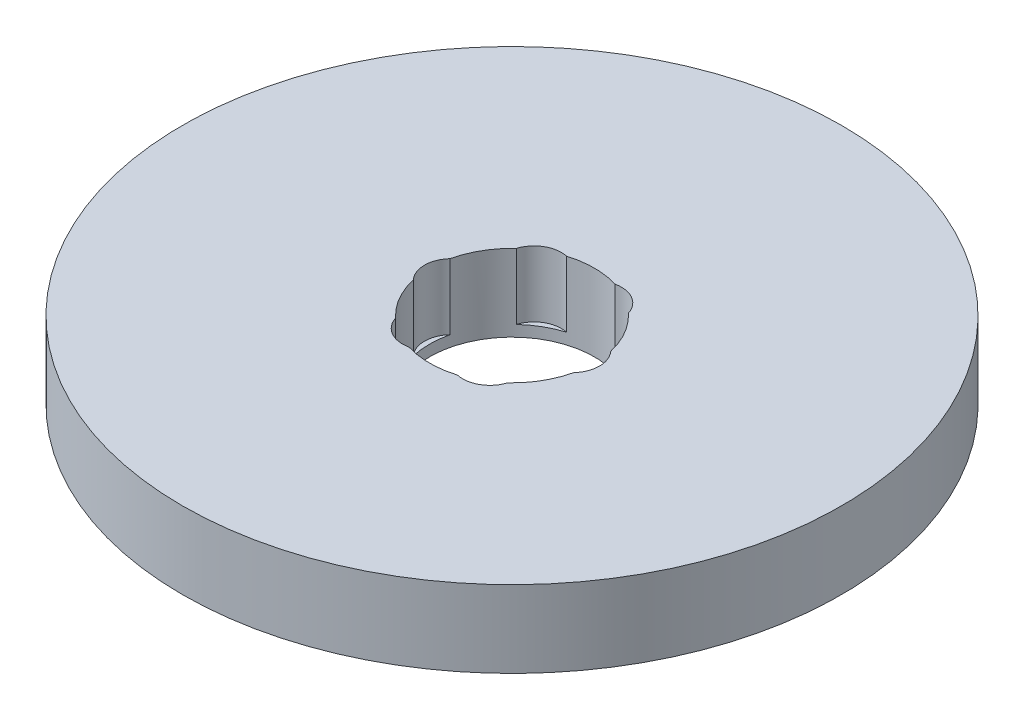
ISO-10303-21;
HEADER;
FILE_DESCRIPTION(('STEP AP214'),'2;1');
FILE_NAME('part.step','',(''),(''),'','','');
FILE_SCHEMA(('AUTOMOTIVE_DESIGN { 1 0 10303 214 1 1 1 1 }'));
ENDSEC;
DATA;
#1=APPLICATION_CONTEXT('core data for automotive mechanical design processes');
#2=APPLICATION_PROTOCOL_DEFINITION('international standard','automotive_design',2000,#1);
#3=PRODUCT_CONTEXT('',#1,'mechanical');
#4=PRODUCT('Part','Part','',(#3));
#5=PRODUCT_RELATED_PRODUCT_CATEGORY('part','',(#4));
#6=PRODUCT_DEFINITION_FORMATION('','',#4);
#7=PRODUCT_DEFINITION_CONTEXT('part definition',#1,'design');
#8=PRODUCT_DEFINITION('design','',#6,#7);
#9=PRODUCT_DEFINITION_SHAPE('','',#8);
#10=(LENGTH_UNIT() NAMED_UNIT(*) SI_UNIT(.MILLI.,.METRE.));
#11=(NAMED_UNIT(*) PLANE_ANGLE_UNIT() SI_UNIT($,.RADIAN.));
#12=(NAMED_UNIT(*) SI_UNIT($,.STERADIAN.) SOLID_ANGLE_UNIT());
#13=UNCERTAINTY_MEASURE_WITH_UNIT(LENGTH_MEASURE(1.E-05),#10,'distance_accuracy_value','');
#14=(GEOMETRIC_REPRESENTATION_CONTEXT(3) GLOBAL_UNCERTAINTY_ASSIGNED_CONTEXT((#13)) GLOBAL_UNIT_ASSIGNED_CONTEXT((#10,
#11,#12)) REPRESENTATION_CONTEXT('',''));
#15=CARTESIAN_POINT('',(0.,0.,0.));
#16=DIRECTION('',(0.,0.,1.));
#17=DIRECTION('',(1.,0.,0.));
#18=AXIS2_PLACEMENT_3D('',#15,#16,#17);
#19=CARTESIAN_POINT('',(0.,21.,0.));
#20=DIRECTION('',(0.,-1.,0.));
#21=DIRECTION('',(0.,0.,-1.));
#22=AXIS2_PLACEMENT_3D('',#19,#20,#21);
#23=CYLINDRICAL_SURFACE('',#22,90.);
#24=CARTESIAN_POINT('',(0.,21.,0.));
#25=DIRECTION('',(0.,1.,0.));
#26=DIRECTION('',(0.,0.,1.));
#27=AXIS2_PLACEMENT_3D('',#24,#25,#26);
#28=CIRCLE('',#27,90.);
#29=CARTESIAN_POINT('',(0.,21.,-90.));
#30=VERTEX_POINT('',#29);
#31=EDGE_CURVE('E165',#30,#30,#28,.T.);
#32=CARTESIAN_POINT('',(0.,0.,0.));
#33=DIRECTION('',(0.,1.,0.));
#34=DIRECTION('',(0.,0.,1.));
#35=AXIS2_PLACEMENT_3D('',#32,#33,#34);
#36=CIRCLE('',#35,90.);
#37=CARTESIAN_POINT('',(0.,0.,-90.));
#38=VERTEX_POINT('',#37);
#39=EDGE_CURVE('E158',#38,#38,#36,.T.);
#40=CARTESIAN_POINT('',(0.,21.,-90.));
#41=CARTESIAN_POINT('',(0.,20.78125,-90.));
#42=CARTESIAN_POINT('',(0.,20.5625,-90.));
#43=CARTESIAN_POINT('',(0.,20.125,-90.));
#44=CARTESIAN_POINT('',(0.,19.90625,-90.));
#45=CARTESIAN_POINT('',(0.,19.46875,-90.));
#46=CARTESIAN_POINT('',(0.,19.25,-90.));
#47=CARTESIAN_POINT('',(0.,18.8125,-90.));
#48=CARTESIAN_POINT('',(0.,18.59375,-90.));
#49=CARTESIAN_POINT('',(0.,18.15625,-90.));
#50=CARTESIAN_POINT('',(0.,17.9375,-90.));
#51=CARTESIAN_POINT('',(0.,17.5,-90.));
#52=CARTESIAN_POINT('',(0.,17.28125,-90.));
#53=CARTESIAN_POINT('',(0.,16.84375,-90.));
#54=CARTESIAN_POINT('',(0.,16.625,-90.));
#55=CARTESIAN_POINT('',(0.,16.1875,-90.));
#56=CARTESIAN_POINT('',(0.,15.96875,-90.));
#57=CARTESIAN_POINT('',(0.,15.53125,-90.));
#58=CARTESIAN_POINT('',(0.,15.3125,-90.));
#59=CARTESIAN_POINT('',(0.,14.875,-90.));
#60=CARTESIAN_POINT('',(0.,14.65625,-90.));
#61=CARTESIAN_POINT('',(0.,14.21875,-90.));
#62=CARTESIAN_POINT('',(0.,14.,-90.));
#63=CARTESIAN_POINT('',(0.,13.5625,-90.));
#64=CARTESIAN_POINT('',(0.,13.34375,-90.));
#65=CARTESIAN_POINT('',(0.,12.90625,-90.));
#66=CARTESIAN_POINT('',(0.,12.6875,-90.));
#67=CARTESIAN_POINT('',(0.,12.25,-90.));
#68=CARTESIAN_POINT('',(0.,12.03125,-90.));
#69=CARTESIAN_POINT('',(0.,11.59375,-90.));
#70=CARTESIAN_POINT('',(0.,11.375,-90.));
#71=CARTESIAN_POINT('',(0.,10.9375,-90.));
#72=CARTESIAN_POINT('',(0.,10.71875,-90.));
#73=CARTESIAN_POINT('',(0.,10.28125,-90.));
#74=CARTESIAN_POINT('',(0.,10.0625,-90.));
#75=CARTESIAN_POINT('',(0.,9.625,-90.));
#76=CARTESIAN_POINT('',(0.,9.40625,-90.));
#77=CARTESIAN_POINT('',(0.,8.96875,-90.));
#78=CARTESIAN_POINT('',(0.,8.75,-90.));
#79=CARTESIAN_POINT('',(0.,8.3125,-90.));
#80=CARTESIAN_POINT('',(0.,8.09375,-90.));
#81=CARTESIAN_POINT('',(0.,7.65625,-90.));
#82=CARTESIAN_POINT('',(0.,7.4375,-90.));
#83=CARTESIAN_POINT('',(0.,7.,-90.));
#84=CARTESIAN_POINT('',(0.,6.78125,-90.));
#85=CARTESIAN_POINT('',(0.,6.34375,-90.));
#86=CARTESIAN_POINT('',(0.,6.125,-90.));
#87=CARTESIAN_POINT('',(0.,5.6875,-90.));
#88=CARTESIAN_POINT('',(0.,5.46875,-90.));
#89=CARTESIAN_POINT('',(0.,5.03125,-90.));
#90=CARTESIAN_POINT('',(0.,4.8125,-90.));
#91=CARTESIAN_POINT('',(0.,4.375,-90.));
#92=CARTESIAN_POINT('',(0.,4.15625,-90.));
#93=CARTESIAN_POINT('',(0.,3.71875,-90.));
#94=CARTESIAN_POINT('',(0.,3.5,-90.));
#95=CARTESIAN_POINT('',(0.,3.0625,-90.));
#96=CARTESIAN_POINT('',(0.,2.84375,-90.));
#97=CARTESIAN_POINT('',(0.,2.40625,-90.));
#98=CARTESIAN_POINT('',(0.,2.1875,-90.));
#99=CARTESIAN_POINT('',(0.,1.75,-90.));
#100=CARTESIAN_POINT('',(0.,1.53125,-90.));
#101=CARTESIAN_POINT('',(0.,1.09375,-90.));
#102=CARTESIAN_POINT('',(0.,0.875000000000001,-90.));
#103=CARTESIAN_POINT('',(0.,0.4375,-90.));
#104=CARTESIAN_POINT('',(0.,0.21875,-90.));
#105=CARTESIAN_POINT('',(0.,0.,-90.));
#106=B_SPLINE_CURVE_WITH_KNOTS('',3,(#40,#41,#42,#43,#44,#45,#46,#47,#48,#49,#50,#51,#52,#53,
#54,#55,#56,#57,#58,#59,#60,#61,#62,#63,#64,#65,#66,#67,#68,#69,#70,#71,#72,#73,#74,#75,#76,#77,
#78,#79,#80,#81,#82,#83,#84,#85,#86,#87,#88,#89,#90,#91,#92,#93,#94,#95,#96,#97,#98,#99,#100,
#101,#102,#103,#104,#105),.UNSPECIFIED.,.F.,.F.,(4,2,2,2,2,2,2,2,2,2,2,2,2,2,2,2,2,2,2,2,2,2,2,
2,2,2,2,2,2,2,2,2,4),(0.,0.656250000000001,1.3125,1.96875,2.625,3.28125,3.9375,4.59375,5.25,
5.90625,6.5625,7.21875,7.875,8.53125,9.1875,9.84375,10.5,11.15625,11.8125,12.46875,13.125,
13.78125,14.4375,15.09375,15.75,16.40625,17.0625,17.71875,18.375,19.03125,19.6875,20.34375,21.),.UNSPECIFIED.);
#107=EDGE_CURVE('BSEAM39',#30,#38,#106,.T.);
#108=ORIENTED_EDGE('',*,*,#31,.F.);
#109=ORIENTED_EDGE('',*,*,#39,.T.);
#110=ORIENTED_EDGE('',*,*,#107,.T.);
#111=ORIENTED_EDGE('',*,*,#107,.F.);
#112=EDGE_LOOP('',(#108,#110,#109,#111));
#113=FACE_BOUND('',#112,.T.);
#114=ADVANCED_FACE('F39',(#113),#23,.T.);
#115=CARTESIAN_POINT('',(0.,21.,0.));
#116=DIRECTION('',(0.,1.,0.));
#117=DIRECTION('',(0.,0.,1.));
#118=AXIS2_PLACEMENT_3D('',#115,#116,#117);
#119=PLANE('',#118);
#120=CARTESIAN_POINT('',(16.4579301722484,21.,0.));
#121=DIRECTION('',(0.,1.,0.));
#122=DIRECTION('',(0.,0.,-1.));
#123=AXIS2_PLACEMENT_3D('',#120,#121,#122);
#124=CIRCLE('',#123,7.43004118657397);
#125=CARTESIAN_POINT('',(21.9319181077129,21.,5.02403902418908));
#126=VERTEX_POINT('',#125);
#127=CARTESIAN_POINT('',(21.9319181077129,21.,-5.02403902418908));
#128=VERTEX_POINT('',#127);
#129=EDGE_CURVE('E218',#126,#128,#124,.T.);
#130=ORIENTED_EDGE('',*,*,#129,.F.);
#131=CARTESIAN_POINT('',(0.,21.,0.));
#132=DIRECTION('',(0.,1.,0.));
#133=DIRECTION('',(0.,0.,1.));
#134=AXIS2_PLACEMENT_3D('',#131,#132,#133);
#135=CIRCLE('',#134,22.5);
#136=CARTESIAN_POINT('',(15.3169044784087,21.,16.4815787229047));
#137=VERTEX_POINT('',#136);
#138=EDGE_CURVE('E163',#137,#126,#135,.T.);
#139=ORIENTED_EDGE('',*,*,#138,.F.);
#140=CARTESIAN_POINT('',(8.22896508612428,21.,14.2529856228775));
#141=DIRECTION('',(0.,1.,0.));
#142=DIRECTION('',(0.866025403784436,0.,-0.500000000000004));
#143=AXIS2_PLACEMENT_3D('',#140,#141,#142);
#144=CIRCLE('',#143,7.43004118657397);
#145=CARTESIAN_POINT('',(6.61501362930442,21.,21.5056177470938));
#146=VERTEX_POINT('',#145);
#147=EDGE_CURVE('E391',#146,#137,#144,.T.);
#148=ORIENTED_EDGE('',*,*,#147,.F.);
#149=CARTESIAN_POINT('',(-6.61501362930428,21.,21.5056177470939));
#150=VERTEX_POINT('',#149);
#151=EDGE_CURVE('E149',#150,#146,#135,.T.);
#152=ORIENTED_EDGE('',*,*,#151,.F.);
#153=CARTESIAN_POINT('',(-8.22896508612417,21.,14.2529856228775));
#154=DIRECTION('',(0.,1.,0.));
#155=DIRECTION('',(0.86602540378444,0.,0.499999999999998));
#156=AXIS2_PLACEMENT_3D('',#153,#154,#155);
#157=CIRCLE('',#156,7.43004118657397);
#158=CARTESIAN_POINT('',(-15.3169044784085,21.,16.4815787229048));
#159=VERTEX_POINT('',#158);
#160=EDGE_CURVE('E128',#159,#150,#157,.T.);
#161=ORIENTED_EDGE('',*,*,#160,.F.);
#162=CARTESIAN_POINT('',(-21.9319181077129,21.,5.02403902418908));
#163=VERTEX_POINT('',#162);
#164=EDGE_CURVE('E148',#163,#159,#135,.T.);
#165=ORIENTED_EDGE('',*,*,#164,.F.);
#166=CARTESIAN_POINT('',(-16.4579301722484,21.,0.));
#167=DIRECTION('',(0.,1.,0.));
#168=DIRECTION('',(0.,0.,1.));
#169=AXIS2_PLACEMENT_3D('',#166,#167,#168);
#170=CIRCLE('',#169,7.43004118657397);
#171=CARTESIAN_POINT('',(-21.9319181077129,21.,-5.02403902418908));
#172=VERTEX_POINT('',#171);
#173=EDGE_CURVE('E178',#172,#163,#170,.T.);
#174=ORIENTED_EDGE('',*,*,#173,.F.);
#175=CARTESIAN_POINT('',(-15.3169044784088,21.,-16.4815787229046));
#176=VERTEX_POINT('',#175);
#177=EDGE_CURVE('E159',#176,#172,#135,.T.);
#178=ORIENTED_EDGE('',*,*,#177,.F.);
#179=CARTESIAN_POINT('',(-8.22896508612437,21.,-14.2529856228774));
#180=DIRECTION('',(0.,1.,0.));
#181=DIRECTION('',(-0.866025403784433,0.,0.50000000000001));
#182=AXIS2_PLACEMENT_3D('',#179,#180,#181);
#183=CIRCLE('',#182,7.43004118657397);
#184=CARTESIAN_POINT('',(-6.61501362930458,21.,-21.5056177470938));
#185=VERTEX_POINT('',#184);
#186=EDGE_CURVE('E376',#185,#176,#183,.T.);
#187=ORIENTED_EDGE('',*,*,#186,.F.);
#188=CARTESIAN_POINT('',(6.61501362930413,21.,-21.5056177470939));
#189=VERTEX_POINT('',#188);
#190=EDGE_CURVE('E170',#189,#185,#135,.T.);
#191=ORIENTED_EDGE('',*,*,#190,.F.);
#192=CARTESIAN_POINT('',(8.22896508612408,21.,-14.2529856228776));
#193=DIRECTION('',(0.,1.,0.));
#194=DIRECTION('',(-0.866025403784443,0.,-0.499999999999992));
#195=AXIS2_PLACEMENT_3D('',#192,#193,#194);
#196=CIRCLE('',#195,7.43004118657397);
#197=CARTESIAN_POINT('',(15.3169044784084,21.,-16.4815787229049));
#198=VERTEX_POINT('',#197);
#199=EDGE_CURVE('E384',#198,#189,#196,.T.);
#200=ORIENTED_EDGE('',*,*,#199,.F.);
#201=EDGE_CURVE('E173',#128,#198,#135,.T.);
#202=ORIENTED_EDGE('',*,*,#201,.F.);
#203=EDGE_LOOP('',(#130,#139,#148,#152,#161,#165,#174,#178,#187,#191,#200,#202));
#204=FACE_BOUND('',#203,.T.);
#205=ORIENTED_EDGE('',*,*,#31,.T.);
#206=EDGE_LOOP('',(#205));
#207=FACE_BOUND('',#206,.T.);
#208=ADVANCED_FACE('F141',(#204,#207),#119,.T.);
#209=CARTESIAN_POINT('',(0.,0.,0.));
#210=DIRECTION('',(0.,1.,0.));
#211=DIRECTION('',(0.,0.,1.));
#212=AXIS2_PLACEMENT_3D('',#209,#210,#211);
#213=PLANE('',#212);
#214=CARTESIAN_POINT('',(0.,0.,0.));
#215=DIRECTION('',(0.,1.,0.));
#216=DIRECTION('',(0.,0.,1.));
#217=AXIS2_PLACEMENT_3D('',#214,#215,#216);
#218=CIRCLE('',#217,22.5);
#219=CARTESIAN_POINT('',(0.,0.,22.5));
#220=VERTEX_POINT('',#219);
#221=EDGE_CURVE('E169',#220,#220,#218,.T.);
#222=ORIENTED_EDGE('',*,*,#221,.T.);
#223=EDGE_LOOP('',(#222));
#224=FACE_BOUND('',#223,.T.);
#225=ORIENTED_EDGE('',*,*,#39,.F.);
#226=EDGE_LOOP('',(#225));
#227=FACE_BOUND('',#226,.T.);
#228=ADVANCED_FACE('F236',(#224,#227),#213,.F.);
#229=CARTESIAN_POINT('',(0.,21.,0.));
#230=DIRECTION('',(0.,-1.,0.));
#231=DIRECTION('',(0.,0.,-1.));
#232=AXIS2_PLACEMENT_3D('',#229,#230,#231);
#233=CYLINDRICAL_SURFACE('',#232,22.5);
#234=DIRECTION('',(0.,1.,0.));
#235=VECTOR('',#234,1.);
#236=CARTESIAN_POINT('',(21.9319181077129,12.0061447631424,5.02403902418907));
#237=LINE('',#236,#235);
#238=CARTESIAN_POINT('',(21.9319181077129,3.0122895262849,5.02403902418908));
#239=VERTEX_POINT('',#238);
#240=EDGE_CURVE('E11',#239,#126,#237,.T.);
#241=ORIENTED_EDGE('',*,*,#240,.F.);
#242=CARTESIAN_POINT('',(0.,3.0122895262849,0.));
#243=DIRECTION('',(0.,1.,0.));
#244=DIRECTION('',(0.,0.,1.));
#245=AXIS2_PLACEMENT_3D('',#242,#243,#244);
#246=CIRCLE('',#245,22.5);
#247=CARTESIAN_POINT('',(21.9319181077129,3.0122895262849,-5.02403902418908));
#248=VERTEX_POINT('',#247);
#249=EDGE_CURVE('E212',#239,#248,#246,.T.);
#250=ORIENTED_EDGE('',*,*,#249,.T.);
#251=DIRECTION('',(0.,1.,0.));
#252=VECTOR('',#251,1.);
#253=CARTESIAN_POINT('',(21.9319181077129,12.0061447631424,-5.02403902418907));
#254=LINE('',#253,#252);
#255=EDGE_CURVE('E46',#128,#248,#254,.F.);
#256=ORIENTED_EDGE('',*,*,#255,.F.);
#257=ORIENTED_EDGE('',*,*,#201,.T.);
#258=DIRECTION('',(0.,1.,0.));
#259=VECTOR('',#258,1.);
#260=CARTESIAN_POINT('',(15.3169044784084,12.0061447631424,-16.4815787229049));
#261=LINE('',#260,#259);
#262=CARTESIAN_POINT('',(15.3169044784084,3.0122895262849,-16.4815787229049));
#263=VERTEX_POINT('',#262);
#264=EDGE_CURVE('E202',#263,#198,#261,.T.);
#265=ORIENTED_EDGE('',*,*,#264,.F.);
#266=CARTESIAN_POINT('',(0.,3.0122895262849,0.));
#267=DIRECTION('',(0.,1.,0.));
#268=DIRECTION('',(0.,0.,1.));
#269=AXIS2_PLACEMENT_3D('',#266,#267,#268);
#270=CIRCLE('',#269,22.5);
#271=CARTESIAN_POINT('',(6.61501362930413,3.0122895262849,-21.5056177470939));
#272=VERTEX_POINT('',#271);
#273=EDGE_CURVE('E200',#263,#272,#270,.T.);
#274=ORIENTED_EDGE('',*,*,#273,.T.);
#275=DIRECTION('',(0.,1.,0.));
#276=VECTOR('',#275,1.);
#277=CARTESIAN_POINT('',(6.61501362930414,12.0061447631424,-21.5056177470939));
#278=LINE('',#277,#276);
#279=EDGE_CURVE('E205',#189,#272,#278,.F.);
#280=ORIENTED_EDGE('',*,*,#279,.F.);
#281=ORIENTED_EDGE('',*,*,#190,.T.);
#282=DIRECTION('',(0.,1.,0.));
#283=VECTOR('',#282,1.);
#284=CARTESIAN_POINT('',(-6.61501362930459,12.0061447631424,-21.5056177470938));
#285=LINE('',#284,#283);
#286=CARTESIAN_POINT('',(-6.61501362930458,3.0122895262849,-21.5056177470938));
#287=VERTEX_POINT('',#286);
#288=EDGE_CURVE('E197',#287,#185,#285,.T.);
#289=ORIENTED_EDGE('',*,*,#288,.F.);
#290=CARTESIAN_POINT('',(0.,3.0122895262849,0.));
#291=DIRECTION('',(0.,1.,0.));
#292=DIRECTION('',(0.,0.,1.));
#293=AXIS2_PLACEMENT_3D('',#290,#291,#292);
#294=CIRCLE('',#293,22.5);
#295=CARTESIAN_POINT('',(-15.3169044784088,3.0122895262849,-16.4815787229046));
#296=VERTEX_POINT('',#295);
#297=EDGE_CURVE('E136',#287,#296,#294,.T.);
#298=ORIENTED_EDGE('',*,*,#297,.T.);
#299=DIRECTION('',(0.,1.,0.));
#300=VECTOR('',#299,1.);
#301=CARTESIAN_POINT('',(-15.3169044784088,12.0061447631424,-16.4815787229046));
#302=LINE('',#301,#300);
#303=EDGE_CURVE('E193',#176,#296,#302,.F.);
#304=ORIENTED_EDGE('',*,*,#303,.F.);
#305=ORIENTED_EDGE('',*,*,#177,.T.);
#306=DIRECTION('',(0.,1.,0.));
#307=VECTOR('',#306,1.);
#308=CARTESIAN_POINT('',(-21.9319181077129,12.0061447631424,-5.02403902418907));
#309=LINE('',#308,#307);
#310=CARTESIAN_POINT('',(-21.9319181077129,3.0122895262849,-5.02403902418908));
#311=VERTEX_POINT('',#310);
#312=EDGE_CURVE('E190',#311,#172,#309,.T.);
#313=ORIENTED_EDGE('',*,*,#312,.F.);
#314=CARTESIAN_POINT('',(0.,3.0122895262849,0.));
#315=DIRECTION('',(0.,1.,0.));
#316=DIRECTION('',(0.,0.,1.));
#317=AXIS2_PLACEMENT_3D('',#314,#315,#316);
#318=CIRCLE('',#317,22.5);
#319=CARTESIAN_POINT('',(-21.9319181077129,3.0122895262849,5.02403902418908));
#320=VERTEX_POINT('',#319);
#321=EDGE_CURVE('E181',#311,#320,#318,.T.);
#322=ORIENTED_EDGE('',*,*,#321,.T.);
#323=DIRECTION('',(0.,1.,0.));
#324=VECTOR('',#323,1.);
#325=CARTESIAN_POINT('',(-21.9319181077129,12.0061447631424,5.02403902418907));
#326=LINE('',#325,#324);
#327=EDGE_CURVE('E160',#163,#320,#326,.F.);
#328=ORIENTED_EDGE('',*,*,#327,.F.);
#329=ORIENTED_EDGE('',*,*,#164,.T.);
#330=DIRECTION('',(0.,1.,0.));
#331=VECTOR('',#330,1.);
#332=CARTESIAN_POINT('',(-15.3169044784085,12.0061447631424,16.4815787229048));
#333=LINE('',#332,#331);
#334=CARTESIAN_POINT('',(-15.3169044784085,3.0122895262849,16.4815787229048));
#335=VERTEX_POINT('',#334);
#336=EDGE_CURVE('E127',#335,#159,#333,.T.);
#337=ORIENTED_EDGE('',*,*,#336,.F.);
#338=CARTESIAN_POINT('',(0.,3.0122895262849,0.));
#339=DIRECTION('',(0.,1.,0.));
#340=DIRECTION('',(0.,0.,1.));
#341=AXIS2_PLACEMENT_3D('',#338,#339,#340);
#342=CIRCLE('',#341,22.5);
#343=CARTESIAN_POINT('',(-6.61501362930428,3.0122895262849,21.5056177470939));
#344=VERTEX_POINT('',#343);
#345=EDGE_CURVE('E188',#335,#344,#342,.T.);
#346=ORIENTED_EDGE('',*,*,#345,.T.);
#347=DIRECTION('',(0.,1.,0.));
#348=VECTOR('',#347,1.);
#349=CARTESIAN_POINT('',(-6.61501362930429,12.0061447631424,21.5056177470939));
#350=LINE('',#349,#348);
#351=EDGE_CURVE('E140',#150,#344,#350,.F.);
#352=ORIENTED_EDGE('',*,*,#351,.F.);
#353=ORIENTED_EDGE('',*,*,#151,.T.);
#354=DIRECTION('',(0.,1.,0.));
#355=VECTOR('',#354,1.);
#356=CARTESIAN_POINT('',(6.61501362930444,12.0061447631424,21.5056177470938));
#357=LINE('',#356,#355);
#358=CARTESIAN_POINT('',(6.61501362930442,3.0122895262849,21.5056177470938));
#359=VERTEX_POINT('',#358);
#360=EDGE_CURVE('E215',#359,#146,#357,.T.);
#361=ORIENTED_EDGE('',*,*,#360,.F.);
#362=CARTESIAN_POINT('',(0.,3.0122895262849,0.));
#363=DIRECTION('',(0.,1.,0.));
#364=DIRECTION('',(0.,0.,1.));
#365=AXIS2_PLACEMENT_3D('',#362,#363,#364);
#366=CIRCLE('',#365,22.5);
#367=CARTESIAN_POINT('',(15.3169044784087,3.0122895262849,16.4815787229047));
#368=VERTEX_POINT('',#367);
#369=EDGE_CURVE('E210',#359,#368,#366,.T.);
#370=ORIENTED_EDGE('',*,*,#369,.T.);
#371=DIRECTION('',(0.,1.,0.));
#372=VECTOR('',#371,1.);
#373=CARTESIAN_POINT('',(15.3169044784087,12.0061447631424,16.4815787229047));
#374=LINE('',#373,#372);
#375=EDGE_CURVE('E209',#137,#368,#374,.F.);
#376=ORIENTED_EDGE('',*,*,#375,.F.);
#377=ORIENTED_EDGE('',*,*,#138,.T.);
#378=EDGE_LOOP('',(#241,#250,#256,#257,#265,#274,#280,#281,#289,#298,#304,#305,#313,#322,#328,
#329,#337,#346,#352,#353,#361,#370,#376,#377));
#379=FACE_BOUND('',#378,.T.);
#380=ORIENTED_EDGE('',*,*,#221,.F.);
#381=EDGE_LOOP('',(#380));
#382=FACE_BOUND('',#381,.T.);
#383=ADVANCED_FACE('F153',(#379,#382),#233,.F.);
#384=CARTESIAN_POINT('',(-16.4579301722484,3.0122895262849,0.));
#385=DIRECTION('',(0.,1.,0.));
#386=DIRECTION('',(0.,0.,1.));
#387=AXIS2_PLACEMENT_3D('',#384,#385,#386);
#388=CYLINDRICAL_SURFACE('',#387,7.43004118657397);
#389=ORIENTED_EDGE('',*,*,#312,.T.);
#390=ORIENTED_EDGE('',*,*,#173,.T.);
#391=ORIENTED_EDGE('',*,*,#327,.T.);
#392=CARTESIAN_POINT('',(-16.4579301722484,3.0122895262849,0.));
#393=DIRECTION('',(0.,1.,0.));
#394=DIRECTION('',(0.,0.,1.));
#395=AXIS2_PLACEMENT_3D('',#392,#393,#394);
#396=CIRCLE('',#395,7.43004118657397);
#397=EDGE_CURVE('E176',#311,#320,#396,.T.);
#398=ORIENTED_EDGE('',*,*,#397,.F.);
#399=EDGE_LOOP('',(#389,#390,#391,#398));
#400=FACE_BOUND('',#399,.T.);
#401=ADVANCED_FACE('F247',(#400),#388,.F.);
#402=CARTESIAN_POINT('',(-16.4579301722484,3.0122895262849,0.));
#403=DIRECTION('',(0.,1.,0.));
#404=DIRECTION('',(0.,0.,1.));
#405=AXIS2_PLACEMENT_3D('',#402,#403,#404);
#406=PLANE('',#405);
#407=ORIENTED_EDGE('',*,*,#397,.T.);
#408=ORIENTED_EDGE('',*,*,#321,.F.);
#409=EDGE_LOOP('',(#407,#408));
#410=FACE_BOUND('',#409,.T.);
#411=ADVANCED_FACE('F252',(#410),#406,.T.);
#412=CARTESIAN_POINT('',(-8.22896508612417,3.0122895262849,14.2529856228775));
#413=DIRECTION('',(0.,1.,0.));
#414=DIRECTION('',(0.,0.,1.));
#415=AXIS2_PLACEMENT_3D('',#412,#413,#414);
#416=CYLINDRICAL_SURFACE('',#415,7.43004118657397);
#417=ORIENTED_EDGE('',*,*,#336,.T.);
#418=ORIENTED_EDGE('',*,*,#160,.T.);
#419=ORIENTED_EDGE('',*,*,#351,.T.);
#420=CARTESIAN_POINT('',(-8.22896508612417,3.0122895262849,14.2529856228775));
#421=DIRECTION('',(0.,1.,0.));
#422=DIRECTION('',(0.86602540378444,0.,0.499999999999998));
#423=AXIS2_PLACEMENT_3D('',#420,#421,#422);
#424=CIRCLE('',#423,7.43004118657397);
#425=EDGE_CURVE('E135',#335,#344,#424,.T.);
#426=ORIENTED_EDGE('',*,*,#425,.F.);
#427=EDGE_LOOP('',(#417,#418,#419,#426));
#428=FACE_BOUND('',#427,.T.);
#429=ADVANCED_FACE('F126',(#428),#416,.F.);
#430=CARTESIAN_POINT('',(-8.22896508612417,3.0122895262849,14.2529856228775));
#431=DIRECTION('',(0.,1.,0.));
#432=DIRECTION('',(0.86602540378444,0.,0.499999999999998));
#433=AXIS2_PLACEMENT_3D('',#430,#431,#432);
#434=PLANE('',#433);
#435=ORIENTED_EDGE('',*,*,#425,.T.);
#436=ORIENTED_EDGE('',*,*,#345,.F.);
#437=EDGE_LOOP('',(#435,#436));
#438=FACE_BOUND('',#437,.T.);
#439=ADVANCED_FACE('F259',(#438),#434,.T.);
#440=CARTESIAN_POINT('',(-8.22896508612437,3.0122895262849,-14.2529856228774));
#441=DIRECTION('',(0.,1.,0.));
#442=DIRECTION('',(0.,0.,1.));
#443=AXIS2_PLACEMENT_3D('',#440,#441,#442);
#444=CYLINDRICAL_SURFACE('',#443,7.43004118657397);
#445=ORIENTED_EDGE('',*,*,#288,.T.);
#446=ORIENTED_EDGE('',*,*,#186,.T.);
#447=ORIENTED_EDGE('',*,*,#303,.T.);
#448=CARTESIAN_POINT('',(-8.22896508612437,3.0122895262849,-14.2529856228774));
#449=DIRECTION('',(0.,1.,0.));
#450=DIRECTION('',(-0.866025403784433,0.,0.50000000000001));
#451=AXIS2_PLACEMENT_3D('',#448,#449,#450);
#452=CIRCLE('',#451,7.43004118657397);
#453=EDGE_CURVE('E380',#287,#296,#452,.T.);
#454=ORIENTED_EDGE('',*,*,#453,.F.);
#455=EDGE_LOOP('',(#445,#446,#447,#454));
#456=FACE_BOUND('',#455,.T.);
#457=ADVANCED_FACE('F265',(#456),#444,.F.);
#458=CARTESIAN_POINT('',(-8.22896508612437,3.0122895262849,-14.2529856228774));
#459=DIRECTION('',(0.,1.,0.));
#460=DIRECTION('',(-0.866025403784433,0.,0.50000000000001));
#461=AXIS2_PLACEMENT_3D('',#458,#459,#460);
#462=PLANE('',#461);
#463=ORIENTED_EDGE('',*,*,#453,.T.);
#464=ORIENTED_EDGE('',*,*,#297,.F.);
#465=EDGE_LOOP('',(#463,#464));
#466=FACE_BOUND('',#465,.T.);
#467=ADVANCED_FACE('F308',(#466),#462,.T.);
#468=CARTESIAN_POINT('',(8.22896508612408,3.0122895262849,-14.2529856228776));
#469=DIRECTION('',(0.,1.,0.));
#470=DIRECTION('',(0.,0.,1.));
#471=AXIS2_PLACEMENT_3D('',#468,#469,#470);
#472=CYLINDRICAL_SURFACE('',#471,7.43004118657397);
#473=ORIENTED_EDGE('',*,*,#264,.T.);
#474=ORIENTED_EDGE('',*,*,#199,.T.);
#475=ORIENTED_EDGE('',*,*,#279,.T.);
#476=CARTESIAN_POINT('',(8.22896508612408,3.0122895262849,-14.2529856228776));
#477=DIRECTION('',(0.,1.,0.));
#478=DIRECTION('',(-0.866025403784443,0.,-0.499999999999992));
#479=AXIS2_PLACEMENT_3D('',#476,#477,#478);
#480=CIRCLE('',#479,7.43004118657397);
#481=EDGE_CURVE('E383',#263,#272,#480,.T.);
#482=ORIENTED_EDGE('',*,*,#481,.F.);
#483=EDGE_LOOP('',(#473,#474,#475,#482));
#484=FACE_BOUND('',#483,.T.);
#485=ADVANCED_FACE('F300',(#484),#472,.F.);
#486=CARTESIAN_POINT('',(8.22896508612408,3.0122895262849,-14.2529856228776));
#487=DIRECTION('',(0.,1.,0.));
#488=DIRECTION('',(-0.866025403784443,0.,-0.499999999999992));
#489=AXIS2_PLACEMENT_3D('',#486,#487,#488);
#490=PLANE('',#489);
#491=ORIENTED_EDGE('',*,*,#481,.T.);
#492=ORIENTED_EDGE('',*,*,#273,.F.);
#493=EDGE_LOOP('',(#491,#492));
#494=FACE_BOUND('',#493,.T.);
#495=ADVANCED_FACE('F270',(#494),#490,.T.);
#496=CARTESIAN_POINT('',(8.22896508612428,3.0122895262849,14.2529856228775));
#497=DIRECTION('',(0.,1.,0.));
#498=DIRECTION('',(0.,0.,1.));
#499=AXIS2_PLACEMENT_3D('',#496,#497,#498);
#500=CYLINDRICAL_SURFACE('',#499,7.43004118657397);
#501=ORIENTED_EDGE('',*,*,#360,.T.);
#502=ORIENTED_EDGE('',*,*,#147,.T.);
#503=ORIENTED_EDGE('',*,*,#375,.T.);
#504=CARTESIAN_POINT('',(8.22896508612428,3.0122895262849,14.2529856228775));
#505=DIRECTION('',(0.,1.,0.));
#506=DIRECTION('',(0.866025403784436,0.,-0.500000000000004));
#507=AXIS2_PLACEMENT_3D('',#504,#505,#506);
#508=CIRCLE('',#507,7.43004118657397);
#509=EDGE_CURVE('E56',#359,#368,#508,.T.);
#510=ORIENTED_EDGE('',*,*,#509,.F.);
#511=EDGE_LOOP('',(#501,#502,#503,#510));
#512=FACE_BOUND('',#511,.T.);
#513=ADVANCED_FACE('F262',(#512),#500,.F.);
#514=CARTESIAN_POINT('',(8.22896508612428,3.0122895262849,14.2529856228775));
#515=DIRECTION('',(0.,1.,0.));
#516=DIRECTION('',(0.866025403784436,0.,-0.500000000000004));
#517=AXIS2_PLACEMENT_3D('',#514,#515,#516);
#518=PLANE('',#517);
#519=ORIENTED_EDGE('',*,*,#509,.T.);
#520=ORIENTED_EDGE('',*,*,#369,.F.);
#521=EDGE_LOOP('',(#519,#520));
#522=FACE_BOUND('',#521,.T.);
#523=ADVANCED_FACE('F228',(#522),#518,.T.);
#524=CARTESIAN_POINT('',(16.4579301722484,3.0122895262849,0.));
#525=DIRECTION('',(0.,1.,0.));
#526=DIRECTION('',(0.,0.,1.));
#527=AXIS2_PLACEMENT_3D('',#524,#525,#526);
#528=CYLINDRICAL_SURFACE('',#527,7.43004118657397);
#529=ORIENTED_EDGE('',*,*,#240,.T.);
#530=ORIENTED_EDGE('',*,*,#129,.T.);
#531=ORIENTED_EDGE('',*,*,#255,.T.);
#532=CARTESIAN_POINT('',(16.4579301722484,3.0122895262849,0.));
#533=DIRECTION('',(0.,1.,0.));
#534=DIRECTION('',(0.,0.,-1.));
#535=AXIS2_PLACEMENT_3D('',#532,#533,#534);
#536=CIRCLE('',#535,7.43004118657397);
#537=EDGE_CURVE('E55',#239,#248,#536,.T.);
#538=ORIENTED_EDGE('',*,*,#537,.F.);
#539=EDGE_LOOP('',(#529,#530,#531,#538));
#540=FACE_BOUND('',#539,.T.);
#541=ADVANCED_FACE('F217',(#540),#528,.F.);
#542=CARTESIAN_POINT('',(16.4579301722484,3.0122895262849,0.));
#543=DIRECTION('',(0.,1.,0.));
#544=DIRECTION('',(0.,0.,-1.));
#545=AXIS2_PLACEMENT_3D('',#542,#543,#544);
#546=PLANE('',#545);
#547=ORIENTED_EDGE('',*,*,#537,.T.);
#548=ORIENTED_EDGE('',*,*,#249,.F.);
#549=EDGE_LOOP('',(#547,#548));
#550=FACE_BOUND('',#549,.T.);
#551=ADVANCED_FACE('F224',(#550),#546,.T.);
#552=CLOSED_SHELL('',(#114,#208,#228,#383,#401,#411,#429,#439,#457,#467,#485,#495,#513,#523,
#541,#551));
#553=MANIFOLD_SOLID_BREP('B2',#552);
#554=ADVANCED_BREP_SHAPE_REPRESENTATION('',(#18,#553),#14);
#555=SHAPE_DEFINITION_REPRESENTATION(#9,#554);
ENDSEC;
END-ISO-10303-21;
